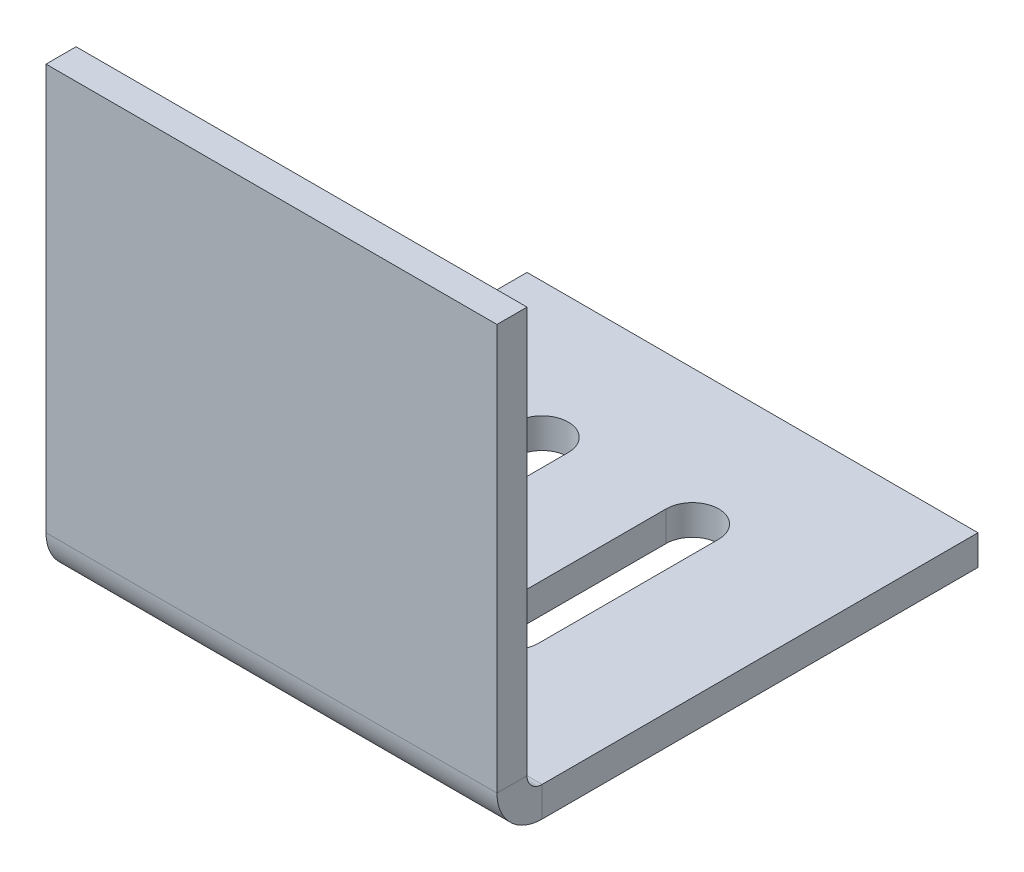
ISO-10303-21;
HEADER;
FILE_DESCRIPTION(('STEP AP214'),'2;1');
FILE_NAME('part.step','',(''),(''),'','','');
FILE_SCHEMA(('AUTOMOTIVE_DESIGN { 1 0 10303 214 1 1 1 1 }'));
ENDSEC;
DATA;
#1=APPLICATION_CONTEXT('core data for automotive mechanical design processes');
#2=APPLICATION_PROTOCOL_DEFINITION('international standard','automotive_design',2000,#1);
#3=PRODUCT_CONTEXT('',#1,'mechanical');
#4=PRODUCT('Part','Part','',(#3));
#5=PRODUCT_RELATED_PRODUCT_CATEGORY('part','',(#4));
#6=PRODUCT_DEFINITION_FORMATION('','',#4);
#7=PRODUCT_DEFINITION_CONTEXT('part definition',#1,'design');
#8=PRODUCT_DEFINITION('design','',#6,#7);
#9=PRODUCT_DEFINITION_SHAPE('','',#8);
#10=(LENGTH_UNIT() NAMED_UNIT(*) SI_UNIT(.MILLI.,.METRE.));
#11=(NAMED_UNIT(*) PLANE_ANGLE_UNIT() SI_UNIT($,.RADIAN.));
#12=(NAMED_UNIT(*) SI_UNIT($,.STERADIAN.) SOLID_ANGLE_UNIT());
#13=UNCERTAINTY_MEASURE_WITH_UNIT(LENGTH_MEASURE(1.E-05),#10,'distance_accuracy_value','');
#14=(GEOMETRIC_REPRESENTATION_CONTEXT(3) GLOBAL_UNCERTAINTY_ASSIGNED_CONTEXT((#13)) GLOBAL_UNIT_ASSIGNED_CONTEXT((#10,
#11,#12)) REPRESENTATION_CONTEXT('',''));
#15=CARTESIAN_POINT('',(0.,0.,0.));
#16=DIRECTION('',(0.,0.,1.));
#17=DIRECTION('',(1.,0.,0.));
#18=AXIS2_PLACEMENT_3D('',#15,#16,#17);
#19=CARTESIAN_POINT('',(15.,-2.,15.));
#20=DIRECTION('',(1.,0.,0.));
#21=DIRECTION('',(0.,0.,-1.));
#22=AXIS2_PLACEMENT_3D('',#19,#20,#21);
#23=PLANE('',#22);
#24=DIRECTION('',(0.,0.,-1.));
#25=VECTOR('',#24,1.);
#26=CARTESIAN_POINT('',(15.,0.,15.));
#27=LINE('',#26,#25);
#28=CARTESIAN_POINT('',(15.,0.,14.));
#29=VERTEX_POINT('',#28);
#30=CARTESIAN_POINT('',(15.,0.,-15.));
#31=VERTEX_POINT('',#30);
#32=EDGE_CURVE('E285',#29,#31,#27,.T.);
#33=ORIENTED_EDGE('',*,*,#32,.F.);
#34=DIRECTION('',(0.,-1.,0.));
#35=VECTOR('',#34,1.);
#36=CARTESIAN_POINT('',(15.,0.,14.));
#37=LINE('',#36,#35);
#38=CARTESIAN_POINT('',(15.,-2.,14.));
#39=VERTEX_POINT('',#38);
#40=EDGE_CURVE('E201',#29,#39,#37,.T.);
#41=ORIENTED_EDGE('',*,*,#40,.T.);
#42=DIRECTION('',(0.,0.,-1.));
#43=VECTOR('',#42,1.);
#44=CARTESIAN_POINT('',(15.,-2.,15.));
#45=LINE('',#44,#43);
#46=CARTESIAN_POINT('',(15.,-2.,-15.));
#47=VERTEX_POINT('',#46);
#48=EDGE_CURVE('E278',#39,#47,#45,.T.);
#49=ORIENTED_EDGE('',*,*,#48,.T.);
#50=DIRECTION('',(0.,1.,0.));
#51=VECTOR('',#50,1.);
#52=CARTESIAN_POINT('',(15.,-2.,-15.));
#53=LINE('',#52,#51);
#54=EDGE_CURVE('E39',#47,#31,#53,.T.);
#55=ORIENTED_EDGE('',*,*,#54,.T.);
#56=EDGE_LOOP('',(#33,#41,#49,#55));
#57=FACE_BOUND('',#56,.T.);
#58=ADVANCED_FACE('F35',(#57),#23,.T.);
#59=CARTESIAN_POINT('',(-15.,-2.,-15.));
#60=DIRECTION('',(0.,1.,0.));
#61=DIRECTION('',(0.,0.,1.));
#62=AXIS2_PLACEMENT_3D('',#59,#60,#61);
#63=PLANE('',#62);
#64=DIRECTION('',(0.,0.,1.));
#65=VECTOR('',#64,1.);
#66=CARTESIAN_POINT('',(-6.75,-2.,6.));
#67=LINE('',#66,#65);
#68=CARTESIAN_POINT('',(-6.75,-2.,-6.));
#69=VERTEX_POINT('',#68);
#70=CARTESIAN_POINT('',(-6.75,-2.,6.));
#71=VERTEX_POINT('',#70);
#72=EDGE_CURVE('E253',#69,#71,#67,.T.);
#73=ORIENTED_EDGE('',*,*,#72,.T.);
#74=CARTESIAN_POINT('',(-5.,-2.,6.));
#75=DIRECTION('',(0.,1.,0.));
#76=DIRECTION('',(0.,0.,1.));
#77=AXIS2_PLACEMENT_3D('',#74,#75,#76);
#78=CIRCLE('',#77,1.75);
#79=CARTESIAN_POINT('',(-3.25,-2.,6.));
#80=VERTEX_POINT('',#79);
#81=EDGE_CURVE('E243',#71,#80,#78,.T.);
#82=ORIENTED_EDGE('',*,*,#81,.T.);
#83=DIRECTION('',(0.,0.,-1.));
#84=VECTOR('',#83,1.);
#85=CARTESIAN_POINT('',(-3.25,-2.,6.));
#86=LINE('',#85,#84);
#87=CARTESIAN_POINT('',(-3.25,-2.,-6.));
#88=VERTEX_POINT('',#87);
#89=EDGE_CURVE('E246',#80,#88,#86,.T.);
#90=ORIENTED_EDGE('',*,*,#89,.T.);
#91=CARTESIAN_POINT('',(-5.,-2.,-6.));
#92=DIRECTION('',(0.,1.,0.));
#93=DIRECTION('',(0.,0.,1.));
#94=AXIS2_PLACEMENT_3D('',#91,#92,#93);
#95=CIRCLE('',#94,1.75);
#96=EDGE_CURVE('E250',#88,#69,#95,.T.);
#97=ORIENTED_EDGE('',*,*,#96,.T.);
#98=EDGE_LOOP('',(#73,#82,#90,#97));
#99=FACE_BOUND('',#98,.T.);
#100=DIRECTION('',(0.,0.,1.));
#101=VECTOR('',#100,1.);
#102=CARTESIAN_POINT('',(3.25,-2.,6.));
#103=LINE('',#102,#101);
#104=CARTESIAN_POINT('',(3.25,-2.,-6.));
#105=VERTEX_POINT('',#104);
#106=CARTESIAN_POINT('',(3.25,-2.,6.));
#107=VERTEX_POINT('',#106);
#108=EDGE_CURVE('E221',#105,#107,#103,.T.);
#109=ORIENTED_EDGE('',*,*,#108,.T.);
#110=CARTESIAN_POINT('',(5.,-2.,6.));
#111=DIRECTION('',(0.,1.,0.));
#112=DIRECTION('',(0.,0.,1.));
#113=AXIS2_PLACEMENT_3D('',#110,#111,#112);
#114=CIRCLE('',#113,1.75);
#115=CARTESIAN_POINT('',(6.75,-2.,6.));
#116=VERTEX_POINT('',#115);
#117=EDGE_CURVE('E213',#107,#116,#114,.T.);
#118=ORIENTED_EDGE('',*,*,#117,.T.);
#119=DIRECTION('',(0.,0.,-1.));
#120=VECTOR('',#119,1.);
#121=CARTESIAN_POINT('',(6.75,-2.,6.));
#122=LINE('',#121,#120);
#123=CARTESIAN_POINT('',(6.75,-2.,-6.));
#124=VERTEX_POINT('',#123);
#125=EDGE_CURVE('E216',#116,#124,#122,.T.);
#126=ORIENTED_EDGE('',*,*,#125,.T.);
#127=CARTESIAN_POINT('',(5.,-2.,-6.));
#128=DIRECTION('',(0.,1.,0.));
#129=DIRECTION('',(0.,0.,1.));
#130=AXIS2_PLACEMENT_3D('',#127,#128,#129);
#131=CIRCLE('',#130,1.75);
#132=EDGE_CURVE('E58',#124,#105,#131,.T.);
#133=ORIENTED_EDGE('',*,*,#132,.T.);
#134=EDGE_LOOP('',(#109,#118,#126,#133));
#135=FACE_BOUND('',#134,.T.);
#136=DIRECTION('',(1.,0.,0.));
#137=VECTOR('',#136,1.);
#138=CARTESIAN_POINT('',(15.,-2.,14.));
#139=LINE('',#138,#137);
#140=CARTESIAN_POINT('',(-15.,-2.,14.));
#141=VERTEX_POINT('',#140);
#142=EDGE_CURVE('E155',#39,#141,#139,.F.);
#143=ORIENTED_EDGE('',*,*,#142,.T.);
#144=DIRECTION('',(0.,0.,1.));
#145=VECTOR('',#144,1.);
#146=CARTESIAN_POINT('',(-15.,-2.,15.));
#147=LINE('',#146,#145);
#148=CARTESIAN_POINT('',(-15.,-2.,-15.));
#149=VERTEX_POINT('',#148);
#150=EDGE_CURVE('E275',#149,#141,#147,.T.);
#151=ORIENTED_EDGE('',*,*,#150,.F.);
#152=DIRECTION('',(-1.,0.,0.));
#153=VECTOR('',#152,1.);
#154=CARTESIAN_POINT('',(15.,-2.,-15.));
#155=LINE('',#154,#153);
#156=EDGE_CURVE('E281',#47,#149,#155,.T.);
#157=ORIENTED_EDGE('',*,*,#156,.F.);
#158=ORIENTED_EDGE('',*,*,#48,.F.);
#159=EDGE_LOOP('',(#143,#151,#157,#158));
#160=FACE_BOUND('',#159,.T.);
#161=ADVANCED_FACE('F324',(#99,#135,#160),#63,.F.);
#162=CARTESIAN_POINT('',(-15.,0.,-15.));
#163=DIRECTION('',(0.,1.,0.));
#164=DIRECTION('',(0.,0.,1.));
#165=AXIS2_PLACEMENT_3D('',#162,#163,#164);
#166=PLANE('',#165);
#167=CARTESIAN_POINT('',(-5.,0.,6.));
#168=DIRECTION('',(0.,1.,0.));
#169=DIRECTION('',(0.,0.,1.));
#170=AXIS2_PLACEMENT_3D('',#167,#168,#169);
#171=CIRCLE('',#170,1.75);
#172=CARTESIAN_POINT('',(-6.75,0.,6.));
#173=VERTEX_POINT('',#172);
#174=CARTESIAN_POINT('',(-3.25,0.,6.));
#175=VERTEX_POINT('',#174);
#176=EDGE_CURVE('E236',#173,#175,#171,.T.);
#177=ORIENTED_EDGE('',*,*,#176,.F.);
#178=DIRECTION('',(0.,0.,1.));
#179=VECTOR('',#178,1.);
#180=CARTESIAN_POINT('',(-6.75,0.,6.));
#181=LINE('',#180,#179);
#182=CARTESIAN_POINT('',(-6.75,0.,-6.));
#183=VERTEX_POINT('',#182);
#184=EDGE_CURVE('E247',#183,#173,#181,.T.);
#185=ORIENTED_EDGE('',*,*,#184,.F.);
#186=CARTESIAN_POINT('',(-5.,0.,-6.));
#187=DIRECTION('',(0.,1.,0.));
#188=DIRECTION('',(0.,0.,1.));
#189=AXIS2_PLACEMENT_3D('',#186,#187,#188);
#190=CIRCLE('',#189,1.75);
#191=CARTESIAN_POINT('',(-3.25,0.,-6.));
#192=VERTEX_POINT('',#191);
#193=EDGE_CURVE('E261',#192,#183,#190,.T.);
#194=ORIENTED_EDGE('',*,*,#193,.F.);
#195=DIRECTION('',(0.,0.,-1.));
#196=VECTOR('',#195,1.);
#197=CARTESIAN_POINT('',(-3.25,0.,6.));
#198=LINE('',#197,#196);
#199=EDGE_CURVE('E258',#175,#192,#198,.T.);
#200=ORIENTED_EDGE('',*,*,#199,.F.);
#201=EDGE_LOOP('',(#177,#185,#194,#200));
#202=FACE_BOUND('',#201,.T.);
#203=CARTESIAN_POINT('',(5.,0.,6.));
#204=DIRECTION('',(0.,1.,0.));
#205=DIRECTION('',(0.,0.,1.));
#206=AXIS2_PLACEMENT_3D('',#203,#204,#205);
#207=CIRCLE('',#206,1.75);
#208=CARTESIAN_POINT('',(3.25,0.,6.));
#209=VERTEX_POINT('',#208);
#210=CARTESIAN_POINT('',(6.75,0.,6.));
#211=VERTEX_POINT('',#210);
#212=EDGE_CURVE('E210',#209,#211,#207,.T.);
#213=ORIENTED_EDGE('',*,*,#212,.F.);
#214=DIRECTION('',(0.,0.,1.));
#215=VECTOR('',#214,1.);
#216=CARTESIAN_POINT('',(3.25,0.,6.));
#217=LINE('',#216,#215);
#218=CARTESIAN_POINT('',(3.25,0.,-6.));
#219=VERTEX_POINT('',#218);
#220=EDGE_CURVE('E217',#219,#209,#217,.T.);
#221=ORIENTED_EDGE('',*,*,#220,.F.);
#222=CARTESIAN_POINT('',(5.,0.,-6.));
#223=DIRECTION('',(0.,1.,0.));
#224=DIRECTION('',(0.,0.,1.));
#225=AXIS2_PLACEMENT_3D('',#222,#223,#224);
#226=CIRCLE('',#225,1.75);
#227=CARTESIAN_POINT('',(6.75,0.,-6.));
#228=VERTEX_POINT('',#227);
#229=EDGE_CURVE('E229',#228,#219,#226,.T.);
#230=ORIENTED_EDGE('',*,*,#229,.F.);
#231=DIRECTION('',(0.,0.,-1.));
#232=VECTOR('',#231,1.);
#233=CARTESIAN_POINT('',(6.75,0.,6.));
#234=LINE('',#233,#232);
#235=EDGE_CURVE('E226',#211,#228,#234,.T.);
#236=ORIENTED_EDGE('',*,*,#235,.F.);
#237=EDGE_LOOP('',(#213,#221,#230,#236));
#238=FACE_BOUND('',#237,.T.);
#239=DIRECTION('',(0.,0.,1.));
#240=VECTOR('',#239,1.);
#241=CARTESIAN_POINT('',(-15.,0.,15.));
#242=LINE('',#241,#240);
#243=CARTESIAN_POINT('',(-15.,0.,-15.));
#244=VERTEX_POINT('',#243);
#245=CARTESIAN_POINT('',(-15.,0.,14.));
#246=VERTEX_POINT('',#245);
#247=EDGE_CURVE('E268',#244,#246,#242,.T.);
#248=ORIENTED_EDGE('',*,*,#247,.T.);
#249=DIRECTION('',(1.,0.,0.));
#250=VECTOR('',#249,1.);
#251=CARTESIAN_POINT('',(15.,0.,14.));
#252=LINE('',#251,#250);
#253=EDGE_CURVE('E50',#29,#246,#252,.F.);
#254=ORIENTED_EDGE('',*,*,#253,.F.);
#255=ORIENTED_EDGE('',*,*,#32,.T.);
#256=DIRECTION('',(-1.,0.,0.));
#257=VECTOR('',#256,1.);
#258=CARTESIAN_POINT('',(15.,0.,-15.));
#259=LINE('',#258,#257);
#260=EDGE_CURVE('E279',#31,#244,#259,.T.);
#261=ORIENTED_EDGE('',*,*,#260,.T.);
#262=EDGE_LOOP('',(#248,#254,#255,#261));
#263=FACE_BOUND('',#262,.T.);
#264=ADVANCED_FACE('F289',(#202,#238,#263),#166,.T.);
#265=CARTESIAN_POINT('',(-15.,-2.,15.));
#266=DIRECTION('',(-1.,0.,0.));
#267=DIRECTION('',(0.,0.,1.));
#268=AXIS2_PLACEMENT_3D('',#265,#266,#267);
#269=PLANE('',#268);
#270=DIRECTION('',(0.,-1.,0.));
#271=VECTOR('',#270,1.);
#272=CARTESIAN_POINT('',(-15.,0.,14.));
#273=LINE('',#272,#271);
#274=EDGE_CURVE('E207',#246,#141,#273,.T.);
#275=ORIENTED_EDGE('',*,*,#274,.F.);
#276=ORIENTED_EDGE('',*,*,#247,.F.);
#277=DIRECTION('',(0.,1.,0.));
#278=VECTOR('',#277,1.);
#279=CARTESIAN_POINT('',(-15.,-2.,-15.));
#280=LINE('',#279,#278);
#281=EDGE_CURVE('E11',#149,#244,#280,.T.);
#282=ORIENTED_EDGE('',*,*,#281,.F.);
#283=ORIENTED_EDGE('',*,*,#150,.T.);
#284=EDGE_LOOP('',(#275,#276,#282,#283));
#285=FACE_BOUND('',#284,.T.);
#286=ADVANCED_FACE('F37',(#285),#269,.T.);
#287=CARTESIAN_POINT('',(15.,-2.,-15.));
#288=DIRECTION('',(0.,0.,-1.));
#289=DIRECTION('',(-1.,0.,0.));
#290=AXIS2_PLACEMENT_3D('',#287,#288,#289);
#291=PLANE('',#290);
#292=ORIENTED_EDGE('',*,*,#260,.F.);
#293=ORIENTED_EDGE('',*,*,#54,.F.);
#294=ORIENTED_EDGE('',*,*,#156,.T.);
#295=ORIENTED_EDGE('',*,*,#281,.T.);
#296=EDGE_LOOP('',(#292,#293,#294,#295));
#297=FACE_BOUND('',#296,.T.);
#298=ADVANCED_FACE('F294',(#297),#291,.T.);
#299=CARTESIAN_POINT('',(-5.,-2.,6.));
#300=DIRECTION('',(0.,1.,0.));
#301=DIRECTION('',(0.,0.,1.));
#302=AXIS2_PLACEMENT_3D('',#299,#300,#301);
#303=CYLINDRICAL_SURFACE('',#302,1.75);
#304=ORIENTED_EDGE('',*,*,#176,.T.);
#305=DIRECTION('',(0.,1.,0.));
#306=VECTOR('',#305,1.);
#307=CARTESIAN_POINT('',(-3.25,-2.,6.));
#308=LINE('',#307,#306);
#309=EDGE_CURVE('E256',#80,#175,#308,.T.);
#310=ORIENTED_EDGE('',*,*,#309,.F.);
#311=ORIENTED_EDGE('',*,*,#81,.F.);
#312=DIRECTION('',(0.,1.,0.));
#313=VECTOR('',#312,1.);
#314=CARTESIAN_POINT('',(-6.75,-2.,6.));
#315=LINE('',#314,#313);
#316=EDGE_CURVE('E266',#71,#173,#315,.T.);
#317=ORIENTED_EDGE('',*,*,#316,.T.);
#318=EDGE_LOOP('',(#304,#310,#311,#317));
#319=FACE_BOUND('',#318,.T.);
#320=ADVANCED_FACE('F334',(#319),#303,.F.);
#321=CARTESIAN_POINT('',(-6.75,-2.,6.));
#322=DIRECTION('',(-1.,0.,0.));
#323=DIRECTION('',(0.,0.,1.));
#324=AXIS2_PLACEMENT_3D('',#321,#322,#323);
#325=PLANE('',#324);
#326=ORIENTED_EDGE('',*,*,#184,.T.);
#327=ORIENTED_EDGE('',*,*,#316,.F.);
#328=ORIENTED_EDGE('',*,*,#72,.F.);
#329=DIRECTION('',(0.,1.,0.));
#330=VECTOR('',#329,1.);
#331=CARTESIAN_POINT('',(-6.75,-2.,-6.));
#332=LINE('',#331,#330);
#333=EDGE_CURVE('E269',#69,#183,#332,.T.);
#334=ORIENTED_EDGE('',*,*,#333,.T.);
#335=EDGE_LOOP('',(#326,#327,#328,#334));
#336=FACE_BOUND('',#335,.T.);
#337=ADVANCED_FACE('F340',(#336),#325,.F.);
#338=CARTESIAN_POINT('',(-5.,-2.,-6.));
#339=DIRECTION('',(0.,1.,0.));
#340=DIRECTION('',(0.,0.,1.));
#341=AXIS2_PLACEMENT_3D('',#338,#339,#340);
#342=CYLINDRICAL_SURFACE('',#341,1.75);
#343=ORIENTED_EDGE('',*,*,#193,.T.);
#344=ORIENTED_EDGE('',*,*,#333,.F.);
#345=ORIENTED_EDGE('',*,*,#96,.F.);
#346=DIRECTION('',(0.,1.,0.));
#347=VECTOR('',#346,1.);
#348=CARTESIAN_POINT('',(-3.25,-2.,-6.));
#349=LINE('',#348,#347);
#350=EDGE_CURVE('E271',#88,#192,#349,.T.);
#351=ORIENTED_EDGE('',*,*,#350,.T.);
#352=EDGE_LOOP('',(#343,#344,#345,#351));
#353=FACE_BOUND('',#352,.T.);
#354=ADVANCED_FACE('F346',(#353),#342,.F.);
#355=CARTESIAN_POINT('',(-3.25,-2.,6.));
#356=DIRECTION('',(1.,0.,0.));
#357=DIRECTION('',(0.,0.,-1.));
#358=AXIS2_PLACEMENT_3D('',#355,#356,#357);
#359=PLANE('',#358);
#360=ORIENTED_EDGE('',*,*,#199,.T.);
#361=ORIENTED_EDGE('',*,*,#350,.F.);
#362=ORIENTED_EDGE('',*,*,#89,.F.);
#363=ORIENTED_EDGE('',*,*,#309,.T.);
#364=EDGE_LOOP('',(#360,#361,#362,#363));
#365=FACE_BOUND('',#364,.T.);
#366=ADVANCED_FACE('F342',(#365),#359,.F.);
#367=CARTESIAN_POINT('',(5.,-2.,6.));
#368=DIRECTION('',(0.,1.,0.));
#369=DIRECTION('',(0.,0.,1.));
#370=AXIS2_PLACEMENT_3D('',#367,#368,#369);
#371=CYLINDRICAL_SURFACE('',#370,1.75);
#372=ORIENTED_EDGE('',*,*,#212,.T.);
#373=DIRECTION('',(0.,1.,0.));
#374=VECTOR('',#373,1.);
#375=CARTESIAN_POINT('',(6.75,-2.,6.));
#376=LINE('',#375,#374);
#377=EDGE_CURVE('E224',#116,#211,#376,.T.);
#378=ORIENTED_EDGE('',*,*,#377,.F.);
#379=ORIENTED_EDGE('',*,*,#117,.F.);
#380=DIRECTION('',(0.,1.,0.));
#381=VECTOR('',#380,1.);
#382=CARTESIAN_POINT('',(3.25,-2.,6.));
#383=LINE('',#382,#381);
#384=EDGE_CURVE('E234',#107,#209,#383,.T.);
#385=ORIENTED_EDGE('',*,*,#384,.T.);
#386=EDGE_LOOP('',(#372,#378,#379,#385));
#387=FACE_BOUND('',#386,.T.);
#388=ADVANCED_FACE('F345',(#387),#371,.F.);
#389=CARTESIAN_POINT('',(3.25,-2.,6.));
#390=DIRECTION('',(-1.,0.,0.));
#391=DIRECTION('',(0.,0.,1.));
#392=AXIS2_PLACEMENT_3D('',#389,#390,#391);
#393=PLANE('',#392);
#394=ORIENTED_EDGE('',*,*,#220,.T.);
#395=ORIENTED_EDGE('',*,*,#384,.F.);
#396=ORIENTED_EDGE('',*,*,#108,.F.);
#397=DIRECTION('',(0.,1.,0.));
#398=VECTOR('',#397,1.);
#399=CARTESIAN_POINT('',(3.25,-2.,-6.));
#400=LINE('',#399,#398);
#401=EDGE_CURVE('E237',#105,#219,#400,.T.);
#402=ORIENTED_EDGE('',*,*,#401,.T.);
#403=EDGE_LOOP('',(#394,#395,#396,#402));
#404=FACE_BOUND('',#403,.T.);
#405=ADVANCED_FACE('F356',(#404),#393,.F.);
#406=CARTESIAN_POINT('',(5.,-2.,-6.));
#407=DIRECTION('',(0.,1.,0.));
#408=DIRECTION('',(0.,0.,1.));
#409=AXIS2_PLACEMENT_3D('',#406,#407,#408);
#410=CYLINDRICAL_SURFACE('',#409,1.75);
#411=ORIENTED_EDGE('',*,*,#229,.T.);
#412=ORIENTED_EDGE('',*,*,#401,.F.);
#413=ORIENTED_EDGE('',*,*,#132,.F.);
#414=DIRECTION('',(0.,1.,0.));
#415=VECTOR('',#414,1.);
#416=CARTESIAN_POINT('',(6.75,-2.,-6.));
#417=LINE('',#416,#415);
#418=EDGE_CURVE('E239',#124,#228,#417,.T.);
#419=ORIENTED_EDGE('',*,*,#418,.T.);
#420=EDGE_LOOP('',(#411,#412,#413,#419));
#421=FACE_BOUND('',#420,.T.);
#422=ADVANCED_FACE('F361',(#421),#410,.F.);
#423=CARTESIAN_POINT('',(6.75,-2.,6.));
#424=DIRECTION('',(1.,0.,0.));
#425=DIRECTION('',(0.,0.,-1.));
#426=AXIS2_PLACEMENT_3D('',#423,#424,#425);
#427=PLANE('',#426);
#428=ORIENTED_EDGE('',*,*,#235,.T.);
#429=ORIENTED_EDGE('',*,*,#418,.F.);
#430=ORIENTED_EDGE('',*,*,#125,.F.);
#431=ORIENTED_EDGE('',*,*,#377,.T.);
#432=EDGE_LOOP('',(#428,#429,#430,#431));
#433=FACE_BOUND('',#432,.T.);
#434=ADVANCED_FACE('F358',(#433),#427,.F.);
#435=CARTESIAN_POINT('',(-15.,0.999999999999997,14.));
#436=DIRECTION('',(-1.,0.,0.));
#437=DIRECTION('',(0.,0.,1.));
#438=AXIS2_PLACEMENT_3D('',#435,#436,#437);
#439=PLANE('',#438);
#440=DIRECTION('',(0.,0.,1.));
#441=VECTOR('',#440,1.);
#442=CARTESIAN_POINT('',(-15.,0.999999999999997,15.));
#443=LINE('',#442,#441);
#444=CARTESIAN_POINT('',(-15.,0.999999999999997,15.));
#445=VERTEX_POINT('',#444);
#446=CARTESIAN_POINT('',(-15.,0.999999999999997,17.));
#447=VERTEX_POINT('',#446);
#448=EDGE_CURVE('E302',#445,#447,#443,.T.);
#449=ORIENTED_EDGE('',*,*,#448,.F.);
#450=CARTESIAN_POINT('',(-15.,0.999999999999997,14.));
#451=DIRECTION('',(1.,0.,0.));
#452=DIRECTION('',(0.,0.,-1.));
#453=AXIS2_PLACEMENT_3D('',#450,#451,#452);
#454=CIRCLE('',#453,0.999999999999999);
#455=EDGE_CURVE('E158',#246,#445,#454,.F.);
#456=ORIENTED_EDGE('',*,*,#455,.F.);
#457=ORIENTED_EDGE('',*,*,#274,.T.);
#458=CARTESIAN_POINT('',(-15.,0.999999999999997,14.));
#459=DIRECTION('',(1.,0.,0.));
#460=DIRECTION('',(0.,0.,-1.));
#461=AXIS2_PLACEMENT_3D('',#458,#459,#460);
#462=CIRCLE('',#461,3.);
#463=EDGE_CURVE('E200',#141,#447,#462,.F.);
#464=ORIENTED_EDGE('',*,*,#463,.T.);
#465=EDGE_LOOP('',(#449,#456,#457,#464));
#466=FACE_BOUND('',#465,.T.);
#467=ADVANCED_FACE('F300',(#466),#439,.T.);
#468=CARTESIAN_POINT('',(15.,0.999999999999997,14.));
#469=DIRECTION('',(-1.,0.,0.));
#470=DIRECTION('',(0.,0.,1.));
#471=AXIS2_PLACEMENT_3D('',#468,#469,#470);
#472=PLANE('',#471);
#473=CARTESIAN_POINT('',(15.,0.999999999999997,14.));
#474=DIRECTION('',(1.,0.,0.));
#475=DIRECTION('',(0.,0.,-1.));
#476=AXIS2_PLACEMENT_3D('',#473,#474,#475);
#477=CIRCLE('',#476,0.999999999999999);
#478=CARTESIAN_POINT('',(15.,0.999999999999997,15.));
#479=VERTEX_POINT('',#478);
#480=EDGE_CURVE('E165',#479,#29,#477,.T.);
#481=ORIENTED_EDGE('',*,*,#480,.F.);
#482=DIRECTION('',(0.,0.,1.));
#483=VECTOR('',#482,1.);
#484=CARTESIAN_POINT('',(15.,0.999999999999997,15.));
#485=LINE('',#484,#483);
#486=CARTESIAN_POINT('',(15.,0.999999999999997,17.));
#487=VERTEX_POINT('',#486);
#488=EDGE_CURVE('E162',#479,#487,#485,.T.);
#489=ORIENTED_EDGE('',*,*,#488,.T.);
#490=CARTESIAN_POINT('',(15.,0.999999999999997,14.));
#491=DIRECTION('',(1.,0.,0.));
#492=DIRECTION('',(0.,0.,-1.));
#493=AXIS2_PLACEMENT_3D('',#490,#491,#492);
#494=CIRCLE('',#493,3.);
#495=EDGE_CURVE('E148',#487,#39,#494,.T.);
#496=ORIENTED_EDGE('',*,*,#495,.T.);
#497=ORIENTED_EDGE('',*,*,#40,.F.);
#498=EDGE_LOOP('',(#481,#489,#496,#497));
#499=FACE_BOUND('',#498,.T.);
#500=ADVANCED_FACE('F163',(#499),#472,.F.);
#501=CARTESIAN_POINT('',(15.,0.999999999999997,14.));
#502=DIRECTION('',(1.,0.,0.));
#503=DIRECTION('',(0.,0.,1.));
#504=AXIS2_PLACEMENT_3D('',#501,#502,#503);
#505=CYLINDRICAL_SURFACE('',#504,3.);
#506=ORIENTED_EDGE('',*,*,#142,.F.);
#507=ORIENTED_EDGE('',*,*,#495,.F.);
#508=DIRECTION('',(-1.,0.,0.));
#509=VECTOR('',#508,1.);
#510=CARTESIAN_POINT('',(-15.,0.999999999999997,17.));
#511=LINE('',#510,#509);
#512=EDGE_CURVE('E153',#487,#447,#511,.T.);
#513=ORIENTED_EDGE('',*,*,#512,.T.);
#514=ORIENTED_EDGE('',*,*,#463,.F.);
#515=EDGE_LOOP('',(#506,#507,#513,#514));
#516=FACE_BOUND('',#515,.T.);
#517=ADVANCED_FACE('F150',(#516),#505,.T.);
#518=CARTESIAN_POINT('',(15.,0.999999999999997,14.));
#519=DIRECTION('',(1.,0.,0.));
#520=DIRECTION('',(0.,0.,1.));
#521=AXIS2_PLACEMENT_3D('',#518,#519,#520);
#522=CYLINDRICAL_SURFACE('',#521,0.999999999999999);
#523=ORIENTED_EDGE('',*,*,#253,.T.);
#524=ORIENTED_EDGE('',*,*,#455,.T.);
#525=DIRECTION('',(1.,0.,0.));
#526=VECTOR('',#525,1.);
#527=CARTESIAN_POINT('',(-15.,0.999999999999997,15.));
#528=LINE('',#527,#526);
#529=EDGE_CURVE('E169',#445,#479,#528,.T.);
#530=ORIENTED_EDGE('',*,*,#529,.T.);
#531=ORIENTED_EDGE('',*,*,#480,.T.);
#532=EDGE_LOOP('',(#523,#524,#530,#531));
#533=FACE_BOUND('',#532,.T.);
#534=ADVANCED_FACE('F305',(#533),#522,.F.);
#535=CARTESIAN_POINT('',(-15.,0.,17.));
#536=DIRECTION('',(1.,0.,0.));
#537=DIRECTION('',(0.,0.,-1.));
#538=AXIS2_PLACEMENT_3D('',#535,#536,#537);
#539=PLANE('',#538);
#540=ORIENTED_EDGE('',*,*,#448,.T.);
#541=DIRECTION('',(0.,-1.,0.));
#542=VECTOR('',#541,1.);
#543=CARTESIAN_POINT('',(-15.,0.,17.));
#544=LINE('',#543,#542);
#545=CARTESIAN_POINT('',(-15.,28.,17.));
#546=VERTEX_POINT('',#545);
#547=EDGE_CURVE('E177',#546,#447,#544,.T.);
#548=ORIENTED_EDGE('',*,*,#547,.F.);
#549=DIRECTION('',(0.,0.,-1.));
#550=VECTOR('',#549,1.);
#551=CARTESIAN_POINT('',(-15.,28.,17.));
#552=LINE('',#551,#550);
#553=CARTESIAN_POINT('',(-15.,28.,15.));
#554=VERTEX_POINT('',#553);
#555=EDGE_CURVE('E186',#546,#554,#552,.T.);
#556=ORIENTED_EDGE('',*,*,#555,.T.);
#557=DIRECTION('',(0.,-1.,0.));
#558=VECTOR('',#557,1.);
#559=CARTESIAN_POINT('',(-15.,0.,15.));
#560=LINE('',#559,#558);
#561=EDGE_CURVE('E178',#554,#445,#560,.T.);
#562=ORIENTED_EDGE('',*,*,#561,.T.);
#563=EDGE_LOOP('',(#540,#548,#556,#562));
#564=FACE_BOUND('',#563,.T.);
#565=ADVANCED_FACE('F312',(#564),#539,.F.);
#566=CARTESIAN_POINT('',(15.,28.,17.));
#567=DIRECTION('',(-1.,0.,0.));
#568=DIRECTION('',(0.,0.,1.));
#569=AXIS2_PLACEMENT_3D('',#566,#567,#568);
#570=PLANE('',#569);
#571=ORIENTED_EDGE('',*,*,#488,.F.);
#572=DIRECTION('',(0.,1.,0.));
#573=VECTOR('',#572,1.);
#574=CARTESIAN_POINT('',(15.,28.,15.));
#575=LINE('',#574,#573);
#576=CARTESIAN_POINT('',(15.,28.,15.));
#577=VERTEX_POINT('',#576);
#578=EDGE_CURVE('E193',#479,#577,#575,.T.);
#579=ORIENTED_EDGE('',*,*,#578,.T.);
#580=DIRECTION('',(0.,0.,-1.));
#581=VECTOR('',#580,1.);
#582=CARTESIAN_POINT('',(15.,28.,17.));
#583=LINE('',#582,#581);
#584=CARTESIAN_POINT('',(15.,28.,17.));
#585=VERTEX_POINT('',#584);
#586=EDGE_CURVE('E182',#585,#577,#583,.T.);
#587=ORIENTED_EDGE('',*,*,#586,.F.);
#588=DIRECTION('',(0.,1.,0.));
#589=VECTOR('',#588,1.);
#590=CARTESIAN_POINT('',(15.,28.,17.));
#591=LINE('',#590,#589);
#592=EDGE_CURVE('E174',#487,#585,#591,.T.);
#593=ORIENTED_EDGE('',*,*,#592,.F.);
#594=EDGE_LOOP('',(#571,#579,#587,#593));
#595=FACE_BOUND('',#594,.T.);
#596=ADVANCED_FACE('F180',(#595),#570,.F.);
#597=CARTESIAN_POINT('',(-15.,28.,17.));
#598=DIRECTION('',(0.,0.,-1.));
#599=DIRECTION('',(-1.,0.,0.));
#600=AXIS2_PLACEMENT_3D('',#597,#598,#599);
#601=PLANE('',#600);
#602=ORIENTED_EDGE('',*,*,#512,.F.);
#603=ORIENTED_EDGE('',*,*,#592,.T.);
#604=DIRECTION('',(-1.,0.,0.));
#605=VECTOR('',#604,1.);
#606=CARTESIAN_POINT('',(-15.,28.,17.));
#607=LINE('',#606,#605);
#608=EDGE_CURVE('E184',#585,#546,#607,.T.);
#609=ORIENTED_EDGE('',*,*,#608,.T.);
#610=ORIENTED_EDGE('',*,*,#547,.T.);
#611=EDGE_LOOP('',(#602,#603,#609,#610));
#612=FACE_BOUND('',#611,.T.);
#613=ADVANCED_FACE('F173',(#612),#601,.F.);
#614=CARTESIAN_POINT('',(-15.,28.,15.));
#615=DIRECTION('',(0.,0.,-1.));
#616=DIRECTION('',(-1.,0.,0.));
#617=AXIS2_PLACEMENT_3D('',#614,#615,#616);
#618=PLANE('',#617);
#619=ORIENTED_EDGE('',*,*,#578,.F.);
#620=ORIENTED_EDGE('',*,*,#529,.F.);
#621=ORIENTED_EDGE('',*,*,#561,.F.);
#622=DIRECTION('',(-1.,0.,0.));
#623=VECTOR('',#622,1.);
#624=CARTESIAN_POINT('',(-15.,28.,15.));
#625=LINE('',#624,#623);
#626=EDGE_CURVE('E188',#577,#554,#625,.T.);
#627=ORIENTED_EDGE('',*,*,#626,.F.);
#628=EDGE_LOOP('',(#619,#620,#621,#627));
#629=FACE_BOUND('',#628,.T.);
#630=ADVANCED_FACE('F308',(#629),#618,.T.);
#631=CARTESIAN_POINT('',(-15.,28.,17.));
#632=DIRECTION('',(0.,-1.,0.));
#633=DIRECTION('',(0.,0.,-1.));
#634=AXIS2_PLACEMENT_3D('',#631,#632,#633);
#635=PLANE('',#634);
#636=ORIENTED_EDGE('',*,*,#626,.T.);
#637=ORIENTED_EDGE('',*,*,#555,.F.);
#638=ORIENTED_EDGE('',*,*,#608,.F.);
#639=ORIENTED_EDGE('',*,*,#586,.T.);
#640=EDGE_LOOP('',(#636,#637,#638,#639));
#641=FACE_BOUND('',#640,.T.);
#642=ADVANCED_FACE('F315',(#641),#635,.F.);
#643=CLOSED_SHELL('',(#58,#161,#264,#286,#298,#320,#337,#354,#366,#388,#405,#422,#434,#467,#500,
#517,#534,#565,#596,#613,#630,#642));
#644=MANIFOLD_SOLID_BREP('B2',#643);
#645=ADVANCED_BREP_SHAPE_REPRESENTATION('',(#18,#644),#14);
#646=SHAPE_DEFINITION_REPRESENTATION(#9,#645);
ENDSEC;
END-ISO-10303-21;
